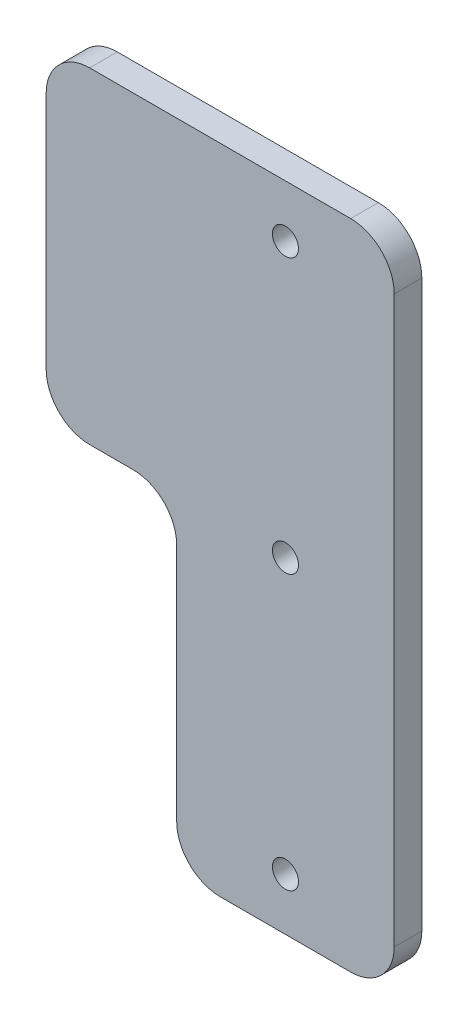
ISO-10303-21;
HEADER;
FILE_DESCRIPTION(('STEP AP214'),'2;1');
FILE_NAME('part.step','',(''),(''),'','','');
FILE_SCHEMA(('AUTOMOTIVE_DESIGN { 1 0 10303 214 1 1 1 1 }'));
ENDSEC;
DATA;
#1=APPLICATION_CONTEXT('core data for automotive mechanical design processes');
#2=APPLICATION_PROTOCOL_DEFINITION('international standard','automotive_design',2000,#1);
#3=PRODUCT_CONTEXT('',#1,'mechanical');
#4=PRODUCT('Part','Part','',(#3));
#5=PRODUCT_RELATED_PRODUCT_CATEGORY('part','',(#4));
#6=PRODUCT_DEFINITION_FORMATION('','',#4);
#7=PRODUCT_DEFINITION_CONTEXT('part definition',#1,'design');
#8=PRODUCT_DEFINITION('design','',#6,#7);
#9=PRODUCT_DEFINITION_SHAPE('','',#8);
#10=(LENGTH_UNIT() NAMED_UNIT(*) SI_UNIT(.MILLI.,.METRE.));
#11=(NAMED_UNIT(*) PLANE_ANGLE_UNIT() SI_UNIT($,.RADIAN.));
#12=(NAMED_UNIT(*) SI_UNIT($,.STERADIAN.) SOLID_ANGLE_UNIT());
#13=UNCERTAINTY_MEASURE_WITH_UNIT(LENGTH_MEASURE(1.E-05),#10,'distance_accuracy_value','');
#14=(GEOMETRIC_REPRESENTATION_CONTEXT(3) GLOBAL_UNCERTAINTY_ASSIGNED_CONTEXT((#13)) GLOBAL_UNIT_ASSIGNED_CONTEXT((#10,
#11,#12)) REPRESENTATION_CONTEXT('',''));
#15=CARTESIAN_POINT('',(0.,0.,0.));
#16=DIRECTION('',(0.,0.,1.));
#17=DIRECTION('',(1.,0.,0.));
#18=AXIS2_PLACEMENT_3D('',#15,#16,#17);
#19=CARTESIAN_POINT('',(0.,75.,3.175));
#20=DIRECTION('',(0.,-1.,0.));
#21=DIRECTION('',(0.,0.,-1.));
#22=AXIS2_PLACEMENT_3D('',#19,#20,#21);
#23=PLANE('',#22);
#24=DIRECTION('',(-1.,0.,0.));
#25=VECTOR('',#24,1.);
#26=CARTESIAN_POINT('',(0.,75.,0.));
#27=LINE('',#26,#25);
#28=CARTESIAN_POINT('',(20.,75.,0.));
#29=VERTEX_POINT('',#28);
#30=CARTESIAN_POINT('',(-10.,75.,0.));
#31=VERTEX_POINT('',#30);
#32=EDGE_CURVE('E161',#29,#31,#27,.T.);
#33=ORIENTED_EDGE('',*,*,#32,.T.);
#34=DIRECTION('',(0.,0.,-1.));
#35=VECTOR('',#34,1.);
#36=CARTESIAN_POINT('',(-10.,75.,3.175));
#37=LINE('',#36,#35);
#38=CARTESIAN_POINT('',(-10.,75.,3.175));
#39=VERTEX_POINT('',#38);
#40=EDGE_CURVE('E135',#31,#39,#37,.F.);
#41=ORIENTED_EDGE('',*,*,#40,.T.);
#42=DIRECTION('',(-1.,0.,0.));
#43=VECTOR('',#42,1.);
#44=CARTESIAN_POINT('',(0.,75.,3.175));
#45=LINE('',#44,#43);
#46=CARTESIAN_POINT('',(20.,75.,3.175));
#47=VERTEX_POINT('',#46);
#48=EDGE_CURVE('E192',#47,#39,#45,.T.);
#49=ORIENTED_EDGE('',*,*,#48,.F.);
#50=DIRECTION('',(0.,0.,-1.));
#51=VECTOR('',#50,1.);
#52=CARTESIAN_POINT('',(20.,75.,3.175));
#53=LINE('',#52,#51);
#54=EDGE_CURVE('E141',#47,#29,#53,.T.);
#55=ORIENTED_EDGE('',*,*,#54,.T.);
#56=EDGE_LOOP('',(#33,#41,#49,#55));
#57=FACE_BOUND('',#56,.T.);
#58=ADVANCED_FACE('F39',(#57),#23,.F.);
#59=CARTESIAN_POINT('',(-15.,0.,3.175));
#60=DIRECTION('',(1.,0.,0.));
#61=DIRECTION('',(0.,0.,-1.));
#62=AXIS2_PLACEMENT_3D('',#59,#60,#61);
#63=PLANE('',#62);
#64=DIRECTION('',(0.,-1.,0.));
#65=VECTOR('',#64,1.);
#66=CARTESIAN_POINT('',(-15.,0.,3.175));
#67=LINE('',#66,#65);
#68=CARTESIAN_POINT('',(-15.,70.,3.175));
#69=VERTEX_POINT('',#68);
#70=CARTESIAN_POINT('',(-15.,42.5,3.175));
#71=VERTEX_POINT('',#70);
#72=EDGE_CURVE('E151',#69,#71,#67,.T.);
#73=ORIENTED_EDGE('',*,*,#72,.F.);
#74=DIRECTION('',(0.,0.,-1.));
#75=VECTOR('',#74,1.);
#76=CARTESIAN_POINT('',(-15.,70.,3.175));
#77=LINE('',#76,#75);
#78=CARTESIAN_POINT('',(-15.,70.,0.));
#79=VERTEX_POINT('',#78);
#80=EDGE_CURVE('E134',#69,#79,#77,.T.);
#81=ORIENTED_EDGE('',*,*,#80,.T.);
#82=DIRECTION('',(0.,-1.,0.));
#83=VECTOR('',#82,1.);
#84=CARTESIAN_POINT('',(-15.,0.,0.));
#85=LINE('',#84,#83);
#86=CARTESIAN_POINT('',(-15.,42.5,0.));
#87=VERTEX_POINT('',#86);
#88=EDGE_CURVE('E148',#79,#87,#85,.T.);
#89=ORIENTED_EDGE('',*,*,#88,.T.);
#90=DIRECTION('',(0.,0.,-1.));
#91=VECTOR('',#90,1.);
#92=CARTESIAN_POINT('',(-15.,42.5,3.175));
#93=LINE('',#92,#91);
#94=EDGE_CURVE('E154',#87,#71,#93,.F.);
#95=ORIENTED_EDGE('',*,*,#94,.T.);
#96=EDGE_LOOP('',(#73,#81,#89,#95));
#97=FACE_BOUND('',#96,.T.);
#98=ADVANCED_FACE('F147',(#97),#63,.F.);
#99=CARTESIAN_POINT('',(0.,37.5,3.175));
#100=DIRECTION('',(0.,-1.,0.));
#101=DIRECTION('',(0.,0.,-1.));
#102=AXIS2_PLACEMENT_3D('',#99,#100,#101);
#103=PLANE('',#102);
#104=DIRECTION('',(-1.,0.,0.));
#105=VECTOR('',#104,1.);
#106=CARTESIAN_POINT('',(0.,37.5,3.175));
#107=LINE('',#106,#105);
#108=CARTESIAN_POINT('',(-5.,37.5,3.175));
#109=VERTEX_POINT('',#108);
#110=CARTESIAN_POINT('',(-10.,37.5,3.175));
#111=VERTEX_POINT('',#110);
#112=EDGE_CURVE('E271',#109,#111,#107,.T.);
#113=ORIENTED_EDGE('',*,*,#112,.T.);
#114=DIRECTION('',(0.,0.,-1.));
#115=VECTOR('',#114,1.);
#116=CARTESIAN_POINT('',(-10.,37.5,0.));
#117=LINE('',#116,#115);
#118=CARTESIAN_POINT('',(-10.,37.5,0.));
#119=VERTEX_POINT('',#118);
#120=EDGE_CURVE('E228',#111,#119,#117,.T.);
#121=ORIENTED_EDGE('',*,*,#120,.T.);
#122=DIRECTION('',(-1.,0.,0.));
#123=VECTOR('',#122,1.);
#124=CARTESIAN_POINT('',(0.,37.5,0.));
#125=LINE('',#124,#123);
#126=CARTESIAN_POINT('',(-5.,37.5,0.));
#127=VERTEX_POINT('',#126);
#128=EDGE_CURVE('E160',#127,#119,#125,.T.);
#129=ORIENTED_EDGE('',*,*,#128,.F.);
#130=DIRECTION('',(0.,0.,-1.));
#131=VECTOR('',#130,1.);
#132=CARTESIAN_POINT('',(-5.,37.5,3.175));
#133=LINE('',#132,#131);
#134=EDGE_CURVE('E225',#127,#109,#133,.F.);
#135=ORIENTED_EDGE('',*,*,#134,.T.);
#136=EDGE_LOOP('',(#113,#121,#129,#135));
#137=FACE_BOUND('',#136,.T.);
#138=ADVANCED_FACE('F259',(#137),#103,.T.);
#139=CARTESIAN_POINT('',(0.,0.,3.175));
#140=DIRECTION('',(-1.,0.,0.));
#141=DIRECTION('',(0.,0.,1.));
#142=AXIS2_PLACEMENT_3D('',#139,#140,#141);
#143=PLANE('',#142);
#144=DIRECTION('',(0.,1.,0.));
#145=VECTOR('',#144,1.);
#146=CARTESIAN_POINT('',(0.,0.,3.175));
#147=LINE('',#146,#145);
#148=CARTESIAN_POINT('',(0.,5.,3.175));
#149=VERTEX_POINT('',#148);
#150=CARTESIAN_POINT('',(0.,32.5,3.175));
#151=VERTEX_POINT('',#150);
#152=EDGE_CURVE('E269',#149,#151,#147,.T.);
#153=ORIENTED_EDGE('',*,*,#152,.T.);
#154=DIRECTION('',(0.,0.,-1.));
#155=VECTOR('',#154,1.);
#156=CARTESIAN_POINT('',(0.,32.5,0.));
#157=LINE('',#156,#155);
#158=CARTESIAN_POINT('',(0.,32.5,0.));
#159=VERTEX_POINT('',#158);
#160=EDGE_CURVE('E235',#151,#159,#157,.T.);
#161=ORIENTED_EDGE('',*,*,#160,.T.);
#162=DIRECTION('',(0.,1.,0.));
#163=VECTOR('',#162,1.);
#164=CARTESIAN_POINT('',(0.,0.,0.));
#165=LINE('',#164,#163);
#166=CARTESIAN_POINT('',(0.,5.,0.));
#167=VERTEX_POINT('',#166);
#168=EDGE_CURVE('E165',#167,#159,#165,.T.);
#169=ORIENTED_EDGE('',*,*,#168,.F.);
#170=DIRECTION('',(0.,0.,-1.));
#171=VECTOR('',#170,1.);
#172=CARTESIAN_POINT('',(0.,5.,3.175));
#173=LINE('',#172,#171);
#174=EDGE_CURVE('E232',#167,#149,#173,.F.);
#175=ORIENTED_EDGE('',*,*,#174,.T.);
#176=EDGE_LOOP('',(#153,#161,#169,#175));
#177=FACE_BOUND('',#176,.T.);
#178=ADVANCED_FACE('F273',(#177),#143,.T.);
#179=CARTESIAN_POINT('',(0.,0.,3.175));
#180=DIRECTION('',(0.,1.,0.));
#181=DIRECTION('',(0.,0.,1.));
#182=AXIS2_PLACEMENT_3D('',#179,#180,#181);
#183=PLANE('',#182);
#184=DIRECTION('',(1.,0.,0.));
#185=VECTOR('',#184,1.);
#186=CARTESIAN_POINT('',(0.,0.,0.));
#187=LINE('',#186,#185);
#188=CARTESIAN_POINT('',(5.,0.,0.));
#189=VERTEX_POINT('',#188);
#190=CARTESIAN_POINT('',(20.,0.,0.));
#191=VERTEX_POINT('',#190);
#192=EDGE_CURVE('E173',#189,#191,#187,.T.);
#193=ORIENTED_EDGE('',*,*,#192,.T.);
#194=DIRECTION('',(0.,0.,-1.));
#195=VECTOR('',#194,1.);
#196=CARTESIAN_POINT('',(20.,0.,3.175));
#197=LINE('',#196,#195);
#198=CARTESIAN_POINT('',(20.,0.,3.175));
#199=VERTEX_POINT('',#198);
#200=EDGE_CURVE('E249',#191,#199,#197,.F.);
#201=ORIENTED_EDGE('',*,*,#200,.T.);
#202=DIRECTION('',(1.,0.,0.));
#203=VECTOR('',#202,1.);
#204=CARTESIAN_POINT('',(0.,0.,3.175));
#205=LINE('',#204,#203);
#206=CARTESIAN_POINT('',(5.,0.,3.175));
#207=VERTEX_POINT('',#206);
#208=EDGE_CURVE('E276',#207,#199,#205,.T.);
#209=ORIENTED_EDGE('',*,*,#208,.F.);
#210=DIRECTION('',(0.,0.,-1.));
#211=VECTOR('',#210,1.);
#212=CARTESIAN_POINT('',(5.,0.,0.));
#213=LINE('',#212,#211);
#214=EDGE_CURVE('E245',#207,#189,#213,.T.);
#215=ORIENTED_EDGE('',*,*,#214,.T.);
#216=EDGE_LOOP('',(#193,#201,#209,#215));
#217=FACE_BOUND('',#216,.T.);
#218=ADVANCED_FACE('F340',(#217),#183,.F.);
#219=CARTESIAN_POINT('',(12.5,6.,3.175));
#220=DIRECTION('',(0.,0.,-1.));
#221=DIRECTION('',(-1.,0.,0.));
#222=AXIS2_PLACEMENT_3D('',#219,#220,#221);
#223=CYLINDRICAL_SURFACE('',#222,1.5);
#224=CARTESIAN_POINT('',(12.5,6.,3.175));
#225=DIRECTION('',(0.,0.,1.));
#226=DIRECTION('',(1.,0.,0.));
#227=AXIS2_PLACEMENT_3D('',#224,#225,#226);
#228=CIRCLE('',#227,1.5);
#229=CARTESIAN_POINT('',(14.,6.,3.175));
#230=VERTEX_POINT('',#229);
#231=EDGE_CURVE('E291',#230,#230,#228,.T.);
#232=ORIENTED_EDGE('',*,*,#231,.T.);
#233=EDGE_LOOP('',(#232));
#234=FACE_BOUND('',#233,.T.);
#235=CARTESIAN_POINT('',(12.5,6.,0.));
#236=DIRECTION('',(0.,0.,1.));
#237=DIRECTION('',(1.,0.,0.));
#238=AXIS2_PLACEMENT_3D('',#235,#236,#237);
#239=CIRCLE('',#238,1.5);
#240=CARTESIAN_POINT('',(14.,6.,0.));
#241=VERTEX_POINT('',#240);
#242=EDGE_CURVE('E184',#241,#241,#239,.T.);
#243=ORIENTED_EDGE('',*,*,#242,.F.);
#244=EDGE_LOOP('',(#243));
#245=FACE_BOUND('',#244,.T.);
#246=ADVANCED_FACE('F358',(#234,#245),#223,.F.);
#247=CARTESIAN_POINT('',(12.5,37.5,3.175));
#248=DIRECTION('',(0.,0.,-1.));
#249=DIRECTION('',(-1.,0.,0.));
#250=AXIS2_PLACEMENT_3D('',#247,#248,#249);
#251=CYLINDRICAL_SURFACE('',#250,1.5);
#252=CARTESIAN_POINT('',(12.5,37.5,3.175));
#253=DIRECTION('',(0.,0.,1.));
#254=DIRECTION('',(1.,0.,0.));
#255=AXIS2_PLACEMENT_3D('',#252,#253,#254);
#256=CIRCLE('',#255,1.5);
#257=CARTESIAN_POINT('',(14.,37.5,3.175));
#258=VERTEX_POINT('',#257);
#259=EDGE_CURVE('E287',#258,#258,#256,.T.);
#260=ORIENTED_EDGE('',*,*,#259,.T.);
#261=EDGE_LOOP('',(#260));
#262=FACE_BOUND('',#261,.T.);
#263=CARTESIAN_POINT('',(12.5,37.5,0.));
#264=DIRECTION('',(0.,0.,1.));
#265=DIRECTION('',(1.,0.,0.));
#266=AXIS2_PLACEMENT_3D('',#263,#264,#265);
#267=CIRCLE('',#266,1.5);
#268=CARTESIAN_POINT('',(14.,37.5,0.));
#269=VERTEX_POINT('',#268);
#270=EDGE_CURVE('E180',#269,#269,#267,.T.);
#271=ORIENTED_EDGE('',*,*,#270,.F.);
#272=EDGE_LOOP('',(#271));
#273=FACE_BOUND('',#272,.T.);
#274=ADVANCED_FACE('F353',(#262,#273),#251,.F.);
#275=CARTESIAN_POINT('',(25.,0.,3.175));
#276=DIRECTION('',(-1.,0.,0.));
#277=DIRECTION('',(0.,0.,1.));
#278=AXIS2_PLACEMENT_3D('',#275,#276,#277);
#279=PLANE('',#278);
#280=DIRECTION('',(0.,1.,0.));
#281=VECTOR('',#280,1.);
#282=CARTESIAN_POINT('',(25.,0.,3.175));
#283=LINE('',#282,#281);
#284=CARTESIAN_POINT('',(25.,5.,3.175));
#285=VERTEX_POINT('',#284);
#286=CARTESIAN_POINT('',(25.,70.,3.175));
#287=VERTEX_POINT('',#286);
#288=EDGE_CURVE('E280',#285,#287,#283,.T.);
#289=ORIENTED_EDGE('',*,*,#288,.F.);
#290=DIRECTION('',(0.,0.,-1.));
#291=VECTOR('',#290,1.);
#292=CARTESIAN_POINT('',(25.,5.,3.175));
#293=LINE('',#292,#291);
#294=CARTESIAN_POINT('',(25.,5.,0.));
#295=VERTEX_POINT('',#294);
#296=EDGE_CURVE('E241',#285,#295,#293,.T.);
#297=ORIENTED_EDGE('',*,*,#296,.T.);
#298=DIRECTION('',(0.,1.,0.));
#299=VECTOR('',#298,1.);
#300=CARTESIAN_POINT('',(25.,0.,0.));
#301=LINE('',#300,#299);
#302=CARTESIAN_POINT('',(25.,70.,0.));
#303=VERTEX_POINT('',#302);
#304=EDGE_CURVE('E177',#295,#303,#301,.T.);
#305=ORIENTED_EDGE('',*,*,#304,.T.);
#306=DIRECTION('',(0.,0.,-1.));
#307=VECTOR('',#306,1.);
#308=CARTESIAN_POINT('',(25.,70.,3.175));
#309=LINE('',#308,#307);
#310=EDGE_CURVE('E55',#303,#287,#309,.F.);
#311=ORIENTED_EDGE('',*,*,#310,.T.);
#312=EDGE_LOOP('',(#289,#297,#305,#311));
#313=FACE_BOUND('',#312,.T.);
#314=ADVANCED_FACE('F308',(#313),#279,.F.);
#315=CARTESIAN_POINT('',(12.5,69.,3.175));
#316=DIRECTION('',(0.,0.,-1.));
#317=DIRECTION('',(-1.,0.,0.));
#318=AXIS2_PLACEMENT_3D('',#315,#316,#317);
#319=CYLINDRICAL_SURFACE('',#318,1.5);
#320=CARTESIAN_POINT('',(12.5,69.,3.175));
#321=DIRECTION('',(0.,0.,1.));
#322=DIRECTION('',(1.,0.,0.));
#323=AXIS2_PLACEMENT_3D('',#320,#321,#322);
#324=CIRCLE('',#323,1.5);
#325=CARTESIAN_POINT('',(14.,69.,3.175));
#326=VERTEX_POINT('',#325);
#327=EDGE_CURVE('E194',#326,#326,#324,.T.);
#328=ORIENTED_EDGE('',*,*,#327,.T.);
#329=EDGE_LOOP('',(#328));
#330=FACE_BOUND('',#329,.T.);
#331=CARTESIAN_POINT('',(12.5,69.,0.));
#332=DIRECTION('',(0.,0.,1.));
#333=DIRECTION('',(1.,0.,0.));
#334=AXIS2_PLACEMENT_3D('',#331,#332,#333);
#335=CIRCLE('',#334,1.5);
#336=CARTESIAN_POINT('',(14.,69.,0.));
#337=VERTEX_POINT('',#336);
#338=EDGE_CURVE('E188',#337,#337,#335,.T.);
#339=ORIENTED_EDGE('',*,*,#338,.F.);
#340=EDGE_LOOP('',(#339));
#341=FACE_BOUND('',#340,.T.);
#342=ADVANCED_FACE('F298',(#330,#341),#319,.F.);
#343=CARTESIAN_POINT('',(0.,0.,3.175));
#344=DIRECTION('',(0.,0.,1.));
#345=DIRECTION('',(1.,0.,0.));
#346=AXIS2_PLACEMENT_3D('',#343,#344,#345);
#347=PLANE('',#346);
#348=ORIENTED_EDGE('',*,*,#48,.T.);
#349=CARTESIAN_POINT('',(-10.,70.,3.175));
#350=DIRECTION('',(0.,0.,1.));
#351=DIRECTION('',(1.,0.,0.));
#352=AXIS2_PLACEMENT_3D('',#349,#350,#351);
#353=CIRCLE('',#352,5.);
#354=EDGE_CURVE('E222',#39,#69,#353,.T.);
#355=ORIENTED_EDGE('',*,*,#354,.T.);
#356=ORIENTED_EDGE('',*,*,#72,.T.);
#357=CARTESIAN_POINT('',(-10.,42.5,3.175));
#358=DIRECTION('',(0.,0.,1.));
#359=DIRECTION('',(1.,0.,0.));
#360=AXIS2_PLACEMENT_3D('',#357,#358,#359);
#361=CIRCLE('',#360,5.);
#362=EDGE_CURVE('E219',#71,#111,#361,.T.);
#363=ORIENTED_EDGE('',*,*,#362,.T.);
#364=ORIENTED_EDGE('',*,*,#112,.F.);
#365=CARTESIAN_POINT('',(-5.,32.5,3.175));
#366=DIRECTION('',(0.,0.,1.));
#367=DIRECTION('',(1.,0.,0.));
#368=AXIS2_PLACEMENT_3D('',#365,#366,#367);
#369=CIRCLE('',#368,5.);
#370=EDGE_CURVE('E11',#109,#151,#369,.F.);
#371=ORIENTED_EDGE('',*,*,#370,.T.);
#372=ORIENTED_EDGE('',*,*,#152,.F.);
#373=CARTESIAN_POINT('',(5.,5.,3.175));
#374=DIRECTION('',(0.,0.,1.));
#375=DIRECTION('',(1.,0.,0.));
#376=AXIS2_PLACEMENT_3D('',#373,#374,#375);
#377=CIRCLE('',#376,5.);
#378=EDGE_CURVE('E214',#149,#207,#377,.T.);
#379=ORIENTED_EDGE('',*,*,#378,.T.);
#380=ORIENTED_EDGE('',*,*,#208,.T.);
#381=CARTESIAN_POINT('',(20.,5.,3.175));
#382=DIRECTION('',(0.,0.,1.));
#383=DIRECTION('',(1.,0.,0.));
#384=AXIS2_PLACEMENT_3D('',#381,#382,#383);
#385=CIRCLE('',#384,5.);
#386=EDGE_CURVE('E62',#199,#285,#385,.T.);
#387=ORIENTED_EDGE('',*,*,#386,.T.);
#388=ORIENTED_EDGE('',*,*,#288,.T.);
#389=CARTESIAN_POINT('',(20.,70.,3.175));
#390=DIRECTION('',(0.,0.,1.));
#391=DIRECTION('',(1.,0.,0.));
#392=AXIS2_PLACEMENT_3D('',#389,#390,#391);
#393=CIRCLE('',#392,5.);
#394=EDGE_CURVE('E211',#287,#47,#393,.T.);
#395=ORIENTED_EDGE('',*,*,#394,.T.);
#396=EDGE_LOOP('',(#348,#355,#356,#363,#364,#371,#372,#379,#380,#387,#388,#395));
#397=FACE_BOUND('',#396,.T.);
#398=ORIENTED_EDGE('',*,*,#259,.F.);
#399=EDGE_LOOP('',(#398));
#400=FACE_BOUND('',#399,.T.);
#401=ORIENTED_EDGE('',*,*,#231,.F.);
#402=EDGE_LOOP('',(#401));
#403=FACE_BOUND('',#402,.T.);
#404=ORIENTED_EDGE('',*,*,#327,.F.);
#405=EDGE_LOOP('',(#404));
#406=FACE_BOUND('',#405,.T.);
#407=ADVANCED_FACE('F267',(#397,#400,#403,#406),#347,.T.);
#408=CARTESIAN_POINT('',(0.,0.,0.));
#409=DIRECTION('',(0.,0.,1.));
#410=DIRECTION('',(1.,0.,0.));
#411=AXIS2_PLACEMENT_3D('',#408,#409,#410);
#412=PLANE('',#411);
#413=ORIENTED_EDGE('',*,*,#88,.F.);
#414=CARTESIAN_POINT('',(-10.,70.,0.));
#415=DIRECTION('',(0.,0.,1.));
#416=DIRECTION('',(1.,0.,0.));
#417=AXIS2_PLACEMENT_3D('',#414,#415,#416);
#418=CIRCLE('',#417,5.);
#419=EDGE_CURVE('E130',#79,#31,#418,.F.);
#420=ORIENTED_EDGE('',*,*,#419,.T.);
#421=ORIENTED_EDGE('',*,*,#32,.F.);
#422=CARTESIAN_POINT('',(20.,70.,0.));
#423=DIRECTION('',(0.,0.,1.));
#424=DIRECTION('',(1.,0.,0.));
#425=AXIS2_PLACEMENT_3D('',#422,#423,#424);
#426=CIRCLE('',#425,5.);
#427=EDGE_CURVE('E153',#29,#303,#426,.F.);
#428=ORIENTED_EDGE('',*,*,#427,.T.);
#429=ORIENTED_EDGE('',*,*,#304,.F.);
#430=CARTESIAN_POINT('',(20.,5.,0.));
#431=DIRECTION('',(0.,0.,1.));
#432=DIRECTION('',(1.,0.,0.));
#433=AXIS2_PLACEMENT_3D('',#430,#431,#432);
#434=CIRCLE('',#433,5.);
#435=EDGE_CURVE('E201',#295,#191,#434,.F.);
#436=ORIENTED_EDGE('',*,*,#435,.T.);
#437=ORIENTED_EDGE('',*,*,#192,.F.);
#438=CARTESIAN_POINT('',(5.,5.,0.));
#439=DIRECTION('',(0.,0.,1.));
#440=DIRECTION('',(1.,0.,0.));
#441=AXIS2_PLACEMENT_3D('',#438,#439,#440);
#442=CIRCLE('',#441,5.);
#443=EDGE_CURVE('E198',#189,#167,#442,.F.);
#444=ORIENTED_EDGE('',*,*,#443,.T.);
#445=ORIENTED_EDGE('',*,*,#168,.T.);
#446=CARTESIAN_POINT('',(-5.,32.5,0.));
#447=DIRECTION('',(0.,0.,1.));
#448=DIRECTION('',(1.,0.,0.));
#449=AXIS2_PLACEMENT_3D('',#446,#447,#448);
#450=CIRCLE('',#449,5.);
#451=EDGE_CURVE('E48',#159,#127,#450,.T.);
#452=ORIENTED_EDGE('',*,*,#451,.T.);
#453=ORIENTED_EDGE('',*,*,#128,.T.);
#454=CARTESIAN_POINT('',(-10.,42.5,0.));
#455=DIRECTION('',(0.,0.,1.));
#456=DIRECTION('',(1.,0.,0.));
#457=AXIS2_PLACEMENT_3D('',#454,#455,#456);
#458=CIRCLE('',#457,5.);
#459=EDGE_CURVE('E142',#119,#87,#458,.F.);
#460=ORIENTED_EDGE('',*,*,#459,.T.);
#461=EDGE_LOOP('',(#413,#420,#421,#428,#429,#436,#437,#444,#445,#452,#453,#460));
#462=FACE_BOUND('',#461,.T.);
#463=ORIENTED_EDGE('',*,*,#270,.T.);
#464=EDGE_LOOP('',(#463));
#465=FACE_BOUND('',#464,.T.);
#466=ORIENTED_EDGE('',*,*,#242,.T.);
#467=EDGE_LOOP('',(#466));
#468=FACE_BOUND('',#467,.T.);
#469=ORIENTED_EDGE('',*,*,#338,.T.);
#470=EDGE_LOOP('',(#469));
#471=FACE_BOUND('',#470,.T.);
#472=ADVANCED_FACE('F156',(#462,#465,#468,#471),#412,.F.);
#473=CARTESIAN_POINT('',(-10.,70.,3.175));
#474=DIRECTION('',(0.,0.,-1.));
#475=DIRECTION('',(-1.,0.,0.));
#476=AXIS2_PLACEMENT_3D('',#473,#474,#475);
#477=CYLINDRICAL_SURFACE('',#476,5.);
#478=ORIENTED_EDGE('',*,*,#354,.F.);
#479=ORIENTED_EDGE('',*,*,#40,.F.);
#480=ORIENTED_EDGE('',*,*,#419,.F.);
#481=ORIENTED_EDGE('',*,*,#80,.F.);
#482=EDGE_LOOP('',(#478,#479,#480,#481));
#483=FACE_BOUND('',#482,.T.);
#484=ADVANCED_FACE('F133',(#483),#477,.T.);
#485=CARTESIAN_POINT('',(-10.,42.5,3.175));
#486=DIRECTION('',(0.,0.,1.));
#487=DIRECTION('',(1.,0.,0.));
#488=AXIS2_PLACEMENT_3D('',#485,#486,#487);
#489=CYLINDRICAL_SURFACE('',#488,5.);
#490=ORIENTED_EDGE('',*,*,#362,.F.);
#491=ORIENTED_EDGE('',*,*,#94,.F.);
#492=ORIENTED_EDGE('',*,*,#459,.F.);
#493=ORIENTED_EDGE('',*,*,#120,.F.);
#494=EDGE_LOOP('',(#490,#491,#492,#493));
#495=FACE_BOUND('',#494,.T.);
#496=ADVANCED_FACE('F321',(#495),#489,.T.);
#497=CARTESIAN_POINT('',(-5.,32.5,3.175));
#498=DIRECTION('',(0.,0.,1.));
#499=DIRECTION('',(1.,0.,0.));
#500=AXIS2_PLACEMENT_3D('',#497,#498,#499);
#501=CYLINDRICAL_SURFACE('',#500,5.);
#502=ORIENTED_EDGE('',*,*,#370,.F.);
#503=ORIENTED_EDGE('',*,*,#134,.F.);
#504=ORIENTED_EDGE('',*,*,#451,.F.);
#505=ORIENTED_EDGE('',*,*,#160,.F.);
#506=EDGE_LOOP('',(#502,#503,#504,#505));
#507=FACE_BOUND('',#506,.T.);
#508=ADVANCED_FACE('F263',(#507),#501,.F.);
#509=CARTESIAN_POINT('',(20.,5.,3.175));
#510=DIRECTION('',(0.,0.,-1.));
#511=DIRECTION('',(-1.,0.,0.));
#512=AXIS2_PLACEMENT_3D('',#509,#510,#511);
#513=CYLINDRICAL_SURFACE('',#512,5.);
#514=ORIENTED_EDGE('',*,*,#386,.F.);
#515=ORIENTED_EDGE('',*,*,#200,.F.);
#516=ORIENTED_EDGE('',*,*,#435,.F.);
#517=ORIENTED_EDGE('',*,*,#296,.F.);
#518=EDGE_LOOP('',(#514,#515,#516,#517));
#519=FACE_BOUND('',#518,.T.);
#520=ADVANCED_FACE('F327',(#519),#513,.T.);
#521=CARTESIAN_POINT('',(5.,5.,3.175));
#522=DIRECTION('',(0.,0.,1.));
#523=DIRECTION('',(1.,0.,0.));
#524=AXIS2_PLACEMENT_3D('',#521,#522,#523);
#525=CYLINDRICAL_SURFACE('',#524,5.);
#526=ORIENTED_EDGE('',*,*,#378,.F.);
#527=ORIENTED_EDGE('',*,*,#174,.F.);
#528=ORIENTED_EDGE('',*,*,#443,.F.);
#529=ORIENTED_EDGE('',*,*,#214,.F.);
#530=EDGE_LOOP('',(#526,#527,#528,#529));
#531=FACE_BOUND('',#530,.T.);
#532=ADVANCED_FACE('F329',(#531),#525,.T.);
#533=CARTESIAN_POINT('',(20.,70.,3.175));
#534=DIRECTION('',(0.,0.,-1.));
#535=DIRECTION('',(-1.,0.,0.));
#536=AXIS2_PLACEMENT_3D('',#533,#534,#535);
#537=CYLINDRICAL_SURFACE('',#536,5.);
#538=ORIENTED_EDGE('',*,*,#394,.F.);
#539=ORIENTED_EDGE('',*,*,#310,.F.);
#540=ORIENTED_EDGE('',*,*,#427,.F.);
#541=ORIENTED_EDGE('',*,*,#54,.F.);
#542=EDGE_LOOP('',(#538,#539,#540,#541));
#543=FACE_BOUND('',#542,.T.);
#544=ADVANCED_FACE('F41',(#543),#537,.T.);
#545=CLOSED_SHELL('',(#58,#98,#138,#178,#218,#246,#274,#314,#342,#407,#472,#484,#496,#508,#520,
#532,#544));
#546=MANIFOLD_SOLID_BREP('B2',#545);
#547=ADVANCED_BREP_SHAPE_REPRESENTATION('',(#18,#546),#14);
#548=SHAPE_DEFINITION_REPRESENTATION(#9,#547);
ENDSEC;
END-ISO-10303-21;
